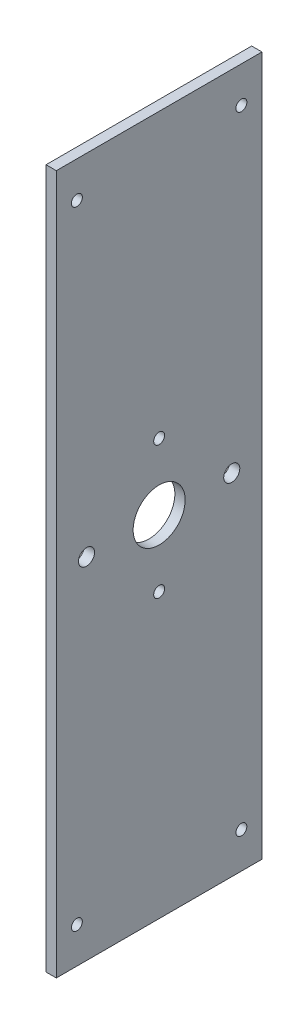
ISO-10303-21;
HEADER;
FILE_DESCRIPTION(('STEP AP214'),'2;1');
FILE_NAME('part.step','',(''),(''),'','','');
FILE_SCHEMA(('AUTOMOTIVE_DESIGN { 1 0 10303 214 1 1 1 1 }'));
ENDSEC;
DATA;
#1=APPLICATION_CONTEXT('core data for automotive mechanical design processes');
#2=APPLICATION_PROTOCOL_DEFINITION('international standard','automotive_design',2000,#1);
#3=PRODUCT_CONTEXT('',#1,'mechanical');
#4=PRODUCT('Part','Part','',(#3));
#5=PRODUCT_RELATED_PRODUCT_CATEGORY('part','',(#4));
#6=PRODUCT_DEFINITION_FORMATION('','',#4);
#7=PRODUCT_DEFINITION_CONTEXT('part definition',#1,'design');
#8=PRODUCT_DEFINITION('design','',#6,#7);
#9=PRODUCT_DEFINITION_SHAPE('','',#8);
#10=(LENGTH_UNIT() NAMED_UNIT(*) SI_UNIT(.MILLI.,.METRE.));
#11=(NAMED_UNIT(*) PLANE_ANGLE_UNIT() SI_UNIT($,.RADIAN.));
#12=(NAMED_UNIT(*) SI_UNIT($,.STERADIAN.) SOLID_ANGLE_UNIT());
#13=UNCERTAINTY_MEASURE_WITH_UNIT(LENGTH_MEASURE(1.E-05),#10,'distance_accuracy_value','');
#14=(GEOMETRIC_REPRESENTATION_CONTEXT(3) GLOBAL_UNCERTAINTY_ASSIGNED_CONTEXT((#13)) GLOBAL_UNIT_ASSIGNED_CONTEXT((#10,
#11,#12)) REPRESENTATION_CONTEXT('',''));
#15=CARTESIAN_POINT('',(0.,0.,0.));
#16=DIRECTION('',(0.,0.,1.));
#17=DIRECTION('',(1.,0.,0.));
#18=AXIS2_PLACEMENT_3D('',#15,#16,#17);
#19=CARTESIAN_POINT('',(-165.1,215.9,2082.8));
#20=DIRECTION('',(-1.,0.,0.));
#21=DIRECTION('',(0.,0.,1.));
#22=AXIS2_PLACEMENT_3D('',#19,#20,#21);
#23=PLANE('',#22);
#24=CARTESIAN_POINT('',(-165.1,0.,1666.4813));
#25=DIRECTION('',(-1.,0.,0.));
#26=DIRECTION('',(0.,0.,1.));
#27=AXIS2_PLACEMENT_3D('',#24,#25,#26);
#28=CIRCLE('',#27,4.96570000000007);
#29=CARTESIAN_POINT('',(-165.1,0.,1671.447));
#30=VERTEX_POINT('',#29);
#31=EDGE_CURVE('E19',#30,#30,#28,.F.);
#32=ORIENTED_EDGE('',*,*,#31,.T.);
#33=EDGE_LOOP('',(#32));
#34=FACE_BOUND('',#33,.T.);
#35=CARTESIAN_POINT('',(-165.1,0.,1756.1687));
#36=DIRECTION('',(-1.,0.,0.));
#37=DIRECTION('',(0.,0.,1.));
#38=AXIS2_PLACEMENT_3D('',#35,#36,#37);
#39=CIRCLE('',#38,4.96570000000007);
#40=CARTESIAN_POINT('',(-165.1,0.,1761.1344));
#41=VERTEX_POINT('',#40);
#42=EDGE_CURVE('E153',#41,#41,#39,.F.);
#43=ORIENTED_EDGE('',*,*,#42,.T.);
#44=EDGE_LOOP('',(#43));
#45=FACE_BOUND('',#44,.T.);
#46=CARTESIAN_POINT('',(-165.1,193.675,1660.525));
#47=DIRECTION('',(-1.,0.,0.));
#48=DIRECTION('',(0.,0.,1.));
#49=AXIS2_PLACEMENT_3D('',#46,#47,#48);
#50=CIRCLE('',#49,3.3782);
#51=CARTESIAN_POINT('',(-165.1,193.675,1663.9032));
#52=VERTEX_POINT('',#51);
#53=EDGE_CURVE('E149',#52,#52,#50,.F.);
#54=ORIENTED_EDGE('',*,*,#53,.T.);
#55=EDGE_LOOP('',(#54));
#56=FACE_BOUND('',#55,.T.);
#57=CARTESIAN_POINT('',(-165.1,193.675,1762.125));
#58=DIRECTION('',(-1.,0.,0.));
#59=DIRECTION('',(0.,0.,1.));
#60=AXIS2_PLACEMENT_3D('',#57,#58,#59);
#61=CIRCLE('',#60,3.3782);
#62=CARTESIAN_POINT('',(-165.1,193.675,1765.5032));
#63=VERTEX_POINT('',#62);
#64=EDGE_CURVE('E144',#63,#63,#61,.F.);
#65=ORIENTED_EDGE('',*,*,#64,.T.);
#66=EDGE_LOOP('',(#65));
#67=FACE_BOUND('',#66,.T.);
#68=CARTESIAN_POINT('',(-165.1,-193.675,1660.525));
#69=DIRECTION('',(-1.,0.,0.));
#70=DIRECTION('',(0.,0.,1.));
#71=AXIS2_PLACEMENT_3D('',#68,#69,#70);
#72=CIRCLE('',#71,3.3782);
#73=CARTESIAN_POINT('',(-165.1,-193.675,1663.9032));
#74=VERTEX_POINT('',#73);
#75=EDGE_CURVE('E139',#74,#74,#72,.F.);
#76=ORIENTED_EDGE('',*,*,#75,.T.);
#77=EDGE_LOOP('',(#76));
#78=FACE_BOUND('',#77,.T.);
#79=CARTESIAN_POINT('',(-165.1,-193.675,1762.125));
#80=DIRECTION('',(-1.,0.,0.));
#81=DIRECTION('',(0.,0.,1.));
#82=AXIS2_PLACEMENT_3D('',#79,#80,#81);
#83=CIRCLE('',#82,3.3782);
#84=CARTESIAN_POINT('',(-165.1,-193.675,1765.5032));
#85=VERTEX_POINT('',#84);
#86=EDGE_CURVE('E134',#85,#85,#83,.F.);
#87=ORIENTED_EDGE('',*,*,#86,.T.);
#88=EDGE_LOOP('',(#87));
#89=FACE_BOUND('',#88,.T.);
#90=CARTESIAN_POINT('',(-165.1,41.021,1711.325));
#91=DIRECTION('',(-1.,0.,0.));
#92=DIRECTION('',(0.,0.,1.));
#93=AXIS2_PLACEMENT_3D('',#90,#91,#92);
#94=CIRCLE('',#93,3.36549999999991);
#95=CARTESIAN_POINT('',(-165.1,41.021,1714.6905));
#96=VERTEX_POINT('',#95);
#97=EDGE_CURVE('E129',#96,#96,#94,.F.);
#98=ORIENTED_EDGE('',*,*,#97,.T.);
#99=EDGE_LOOP('',(#98));
#100=FACE_BOUND('',#99,.T.);
#101=CARTESIAN_POINT('',(-165.1,-41.021,1711.325));
#102=DIRECTION('',(-1.,0.,0.));
#103=DIRECTION('',(0.,0.,1.));
#104=AXIS2_PLACEMENT_3D('',#101,#102,#103);
#105=CIRCLE('',#104,3.36549999999991);
#106=CARTESIAN_POINT('',(-165.1,-41.021,1714.6905));
#107=VERTEX_POINT('',#106);
#108=EDGE_CURVE('E124',#107,#107,#105,.F.);
#109=ORIENTED_EDGE('',*,*,#108,.T.);
#110=EDGE_LOOP('',(#109));
#111=FACE_BOUND('',#110,.T.);
#112=CARTESIAN_POINT('',(-165.1,0.,1711.325));
#113=DIRECTION('',(-1.,0.,0.));
#114=DIRECTION('',(0.,0.,1.));
#115=AXIS2_PLACEMENT_3D('',#112,#113,#114);
#116=CIRCLE('',#115,16.0655);
#117=CARTESIAN_POINT('',(-165.1,0.,1727.3905));
#118=VERTEX_POINT('',#117);
#119=EDGE_CURVE('E110',#118,#118,#116,.F.);
#120=ORIENTED_EDGE('',*,*,#119,.T.);
#121=EDGE_LOOP('',(#120));
#122=FACE_BOUND('',#121,.T.);
#123=DIRECTION('',(0.,0.,-1.));
#124=VECTOR('',#123,1.);
#125=CARTESIAN_POINT('',(-165.1,-215.9,2082.8));
#126=LINE('',#125,#124);
#127=CARTESIAN_POINT('',(-165.1,-215.9,1774.825));
#128=VERTEX_POINT('',#127);
#129=CARTESIAN_POINT('',(-165.1,-215.9,1647.825));
#130=VERTEX_POINT('',#129);
#131=EDGE_CURVE('E105',#128,#130,#126,.T.);
#132=ORIENTED_EDGE('',*,*,#131,.F.);
#133=DIRECTION('',(0.,-1.,0.));
#134=VECTOR('',#133,1.);
#135=CARTESIAN_POINT('',(-165.1,215.9,1774.825));
#136=LINE('',#135,#134);
#137=CARTESIAN_POINT('',(-165.1,215.9,1774.825));
#138=VERTEX_POINT('',#137);
#139=EDGE_CURVE('E40',#138,#128,#136,.T.);
#140=ORIENTED_EDGE('',*,*,#139,.F.);
#141=DIRECTION('',(0.,0.,-1.));
#142=VECTOR('',#141,1.);
#143=CARTESIAN_POINT('',(-165.1,215.9,2082.8));
#144=LINE('',#143,#142);
#145=CARTESIAN_POINT('',(-165.1,215.9,1647.825));
#146=VERTEX_POINT('',#145);
#147=EDGE_CURVE('E92',#138,#146,#144,.T.);
#148=ORIENTED_EDGE('',*,*,#147,.T.);
#149=DIRECTION('',(0.,-1.,0.));
#150=VECTOR('',#149,1.);
#151=CARTESIAN_POINT('',(-165.1,215.9,1647.825));
#152=LINE('',#151,#150);
#153=EDGE_CURVE('E11',#146,#130,#152,.T.);
#154=ORIENTED_EDGE('',*,*,#153,.T.);
#155=EDGE_LOOP('',(#132,#140,#148,#154));
#156=FACE_BOUND('',#155,.T.);
#157=ADVANCED_FACE('F16',(#34,#45,#56,#67,#78,#89,#100,#111,#122,#156),#23,.T.);
#158=CARTESIAN_POINT('',(-161.657917049904,215.9,1647.825));
#159=DIRECTION('',(0.,0.,-1.));
#160=DIRECTION('',(-1.,0.,0.));
#161=AXIS2_PLACEMENT_3D('',#158,#159,#160);
#162=PLANE('',#161);
#163=DIRECTION('',(1.,0.,0.));
#164=VECTOR('',#163,1.);
#165=CARTESIAN_POINT('',(-161.657917049904,-215.9,1647.825));
#166=LINE('',#165,#164);
#167=CARTESIAN_POINT('',(-158.75,-215.9,1647.825));
#168=VERTEX_POINT('',#167);
#169=EDGE_CURVE('E109',#130,#168,#166,.T.);
#170=ORIENTED_EDGE('',*,*,#169,.F.);
#171=ORIENTED_EDGE('',*,*,#153,.F.);
#172=DIRECTION('',(1.,0.,0.));
#173=VECTOR('',#172,1.);
#174=CARTESIAN_POINT('',(-161.657917049904,215.9,1647.825));
#175=LINE('',#174,#173);
#176=CARTESIAN_POINT('',(-158.75,215.9,1647.825));
#177=VERTEX_POINT('',#176);
#178=EDGE_CURVE('E87',#146,#177,#175,.T.);
#179=ORIENTED_EDGE('',*,*,#178,.T.);
#180=DIRECTION('',(0.,-1.,0.));
#181=VECTOR('',#180,1.);
#182=CARTESIAN_POINT('',(-158.75,215.9,1647.825));
#183=LINE('',#182,#181);
#184=EDGE_CURVE('E26',#177,#168,#183,.T.);
#185=ORIENTED_EDGE('',*,*,#184,.T.);
#186=EDGE_LOOP('',(#170,#171,#179,#185));
#187=FACE_BOUND('',#186,.T.);
#188=ADVANCED_FACE('F88',(#187),#162,.T.);
#189=CARTESIAN_POINT('',(-158.75,215.9,1176.90814380646));
#190=DIRECTION('',(-1.,0.,0.));
#191=DIRECTION('',(0.,0.,1.));
#192=AXIS2_PLACEMENT_3D('',#189,#190,#191);
#193=PLANE('',#192);
#194=CARTESIAN_POINT('',(-158.75,0.,1666.4813));
#195=DIRECTION('',(1.,0.,0.));
#196=DIRECTION('',(0.,0.,-1.));
#197=AXIS2_PLACEMENT_3D('',#194,#195,#196);
#198=CIRCLE('',#197,4.96570000000007);
#199=CARTESIAN_POINT('',(-158.75,0.,1661.5156));
#200=VERTEX_POINT('',#199);
#201=EDGE_CURVE('E173',#200,#200,#198,.T.);
#202=ORIENTED_EDGE('',*,*,#201,.F.);
#203=EDGE_LOOP('',(#202));
#204=FACE_BOUND('',#203,.T.);
#205=CARTESIAN_POINT('',(-158.75,0.,1756.1687));
#206=DIRECTION('',(1.,0.,0.));
#207=DIRECTION('',(0.,0.,-1.));
#208=AXIS2_PLACEMENT_3D('',#205,#206,#207);
#209=CIRCLE('',#208,4.96570000000007);
#210=CARTESIAN_POINT('',(-158.75,0.,1751.203));
#211=VERTEX_POINT('',#210);
#212=EDGE_CURVE('E156',#211,#211,#209,.T.);
#213=ORIENTED_EDGE('',*,*,#212,.F.);
#214=EDGE_LOOP('',(#213));
#215=FACE_BOUND('',#214,.T.);
#216=CARTESIAN_POINT('',(-158.75,193.675,1660.525));
#217=DIRECTION('',(1.,0.,0.));
#218=DIRECTION('',(0.,0.,-1.));
#219=AXIS2_PLACEMENT_3D('',#216,#217,#218);
#220=CIRCLE('',#219,3.3782);
#221=CARTESIAN_POINT('',(-158.75,193.675,1657.1468));
#222=VERTEX_POINT('',#221);
#223=EDGE_CURVE('E152',#222,#222,#220,.T.);
#224=ORIENTED_EDGE('',*,*,#223,.F.);
#225=EDGE_LOOP('',(#224));
#226=FACE_BOUND('',#225,.T.);
#227=CARTESIAN_POINT('',(-158.75,193.675,1762.125));
#228=DIRECTION('',(1.,0.,0.));
#229=DIRECTION('',(0.,0.,-1.));
#230=AXIS2_PLACEMENT_3D('',#227,#228,#229);
#231=CIRCLE('',#230,3.3782);
#232=CARTESIAN_POINT('',(-158.75,193.675,1758.7468));
#233=VERTEX_POINT('',#232);
#234=EDGE_CURVE('E148',#233,#233,#231,.T.);
#235=ORIENTED_EDGE('',*,*,#234,.F.);
#236=EDGE_LOOP('',(#235));
#237=FACE_BOUND('',#236,.T.);
#238=CARTESIAN_POINT('',(-158.75,-193.675,1660.525));
#239=DIRECTION('',(1.,0.,0.));
#240=DIRECTION('',(0.,0.,-1.));
#241=AXIS2_PLACEMENT_3D('',#238,#239,#240);
#242=CIRCLE('',#241,3.3782);
#243=CARTESIAN_POINT('',(-158.75,-193.675,1657.1468));
#244=VERTEX_POINT('',#243);
#245=EDGE_CURVE('E143',#244,#244,#242,.T.);
#246=ORIENTED_EDGE('',*,*,#245,.F.);
#247=EDGE_LOOP('',(#246));
#248=FACE_BOUND('',#247,.T.);
#249=CARTESIAN_POINT('',(-158.75,-193.675,1762.125));
#250=DIRECTION('',(1.,0.,0.));
#251=DIRECTION('',(0.,0.,-1.));
#252=AXIS2_PLACEMENT_3D('',#249,#250,#251);
#253=CIRCLE('',#252,3.3782);
#254=CARTESIAN_POINT('',(-158.75,-193.675,1758.7468));
#255=VERTEX_POINT('',#254);
#256=EDGE_CURVE('E138',#255,#255,#253,.T.);
#257=ORIENTED_EDGE('',*,*,#256,.F.);
#258=EDGE_LOOP('',(#257));
#259=FACE_BOUND('',#258,.T.);
#260=CARTESIAN_POINT('',(-158.75,41.021,1711.325));
#261=DIRECTION('',(1.,0.,0.));
#262=DIRECTION('',(0.,0.,-1.));
#263=AXIS2_PLACEMENT_3D('',#260,#261,#262);
#264=CIRCLE('',#263,3.36549999999991);
#265=CARTESIAN_POINT('',(-158.75,41.021,1707.9595));
#266=VERTEX_POINT('',#265);
#267=EDGE_CURVE('E133',#266,#266,#264,.T.);
#268=ORIENTED_EDGE('',*,*,#267,.F.);
#269=EDGE_LOOP('',(#268));
#270=FACE_BOUND('',#269,.T.);
#271=CARTESIAN_POINT('',(-158.75,-41.021,1711.325));
#272=DIRECTION('',(1.,0.,0.));
#273=DIRECTION('',(0.,0.,-1.));
#274=AXIS2_PLACEMENT_3D('',#271,#272,#273);
#275=CIRCLE('',#274,3.36549999999991);
#276=CARTESIAN_POINT('',(-158.75,-41.021,1707.9595));
#277=VERTEX_POINT('',#276);
#278=EDGE_CURVE('E128',#277,#277,#275,.T.);
#279=ORIENTED_EDGE('',*,*,#278,.F.);
#280=EDGE_LOOP('',(#279));
#281=FACE_BOUND('',#280,.T.);
#282=CARTESIAN_POINT('',(-158.75,0.,1711.325));
#283=DIRECTION('',(1.,0.,0.));
#284=DIRECTION('',(0.,0.,-1.));
#285=AXIS2_PLACEMENT_3D('',#282,#283,#284);
#286=CIRCLE('',#285,16.0655);
#287=CARTESIAN_POINT('',(-158.75,0.,1695.2595));
#288=VERTEX_POINT('',#287);
#289=EDGE_CURVE('E123',#288,#288,#286,.T.);
#290=ORIENTED_EDGE('',*,*,#289,.F.);
#291=EDGE_LOOP('',(#290));
#292=FACE_BOUND('',#291,.T.);
#293=DIRECTION('',(0.,0.,-1.));
#294=VECTOR('',#293,1.);
#295=CARTESIAN_POINT('',(-158.75,-215.9,1176.90814380646));
#296=LINE('',#295,#294);
#297=CARTESIAN_POINT('',(-158.75,-215.9,1774.825));
#298=VERTEX_POINT('',#297);
#299=EDGE_CURVE('E83',#298,#168,#296,.T.);
#300=ORIENTED_EDGE('',*,*,#299,.T.);
#301=ORIENTED_EDGE('',*,*,#184,.F.);
#302=DIRECTION('',(0.,0.,-1.));
#303=VECTOR('',#302,1.);
#304=CARTESIAN_POINT('',(-158.75,215.9,1176.90814380646));
#305=LINE('',#304,#303);
#306=CARTESIAN_POINT('',(-158.75,215.9,1774.825));
#307=VERTEX_POINT('',#306);
#308=EDGE_CURVE('E80',#307,#177,#305,.T.);
#309=ORIENTED_EDGE('',*,*,#308,.F.);
#310=DIRECTION('',(0.,-1.,0.));
#311=VECTOR('',#310,1.);
#312=CARTESIAN_POINT('',(-158.75,215.9,1774.825));
#313=LINE('',#312,#311);
#314=EDGE_CURVE('E60',#307,#298,#313,.T.);
#315=ORIENTED_EDGE('',*,*,#314,.T.);
#316=EDGE_LOOP('',(#300,#301,#309,#315));
#317=FACE_BOUND('',#316,.T.);
#318=ADVANCED_FACE('F78',(#204,#215,#226,#237,#248,#259,#270,#281,#292,#317),#193,.F.);
#319=CARTESIAN_POINT('',(-161.657917049904,215.9,1774.825));
#320=DIRECTION('',(0.,0.,-1.));
#321=DIRECTION('',(-1.,0.,0.));
#322=AXIS2_PLACEMENT_3D('',#319,#320,#321);
#323=PLANE('',#322);
#324=DIRECTION('',(1.,0.,0.));
#325=VECTOR('',#324,1.);
#326=CARTESIAN_POINT('',(-161.657917049904,-215.9,1774.825));
#327=LINE('',#326,#325);
#328=EDGE_CURVE('E114',#128,#298,#327,.T.);
#329=ORIENTED_EDGE('',*,*,#328,.T.);
#330=ORIENTED_EDGE('',*,*,#314,.F.);
#331=DIRECTION('',(1.,0.,0.));
#332=VECTOR('',#331,1.);
#333=CARTESIAN_POINT('',(-161.657917049904,215.9,1774.825));
#334=LINE('',#333,#332);
#335=EDGE_CURVE('E95',#138,#307,#334,.T.);
#336=ORIENTED_EDGE('',*,*,#335,.F.);
#337=ORIENTED_EDGE('',*,*,#139,.T.);
#338=EDGE_LOOP('',(#329,#330,#336,#337));
#339=FACE_BOUND('',#338,.T.);
#340=ADVANCED_FACE('F197',(#339),#323,.F.);
#341=CARTESIAN_POINT('',(-187.325,215.9,1041.4));
#342=DIRECTION('',(0.,-1.,0.));
#343=DIRECTION('',(1.,0.,0.));
#344=AXIS2_PLACEMENT_3D('',#341,#342,#343);
#345=PLANE('',#344);
#346=ORIENTED_EDGE('',*,*,#147,.F.);
#347=ORIENTED_EDGE('',*,*,#335,.T.);
#348=ORIENTED_EDGE('',*,*,#308,.T.);
#349=ORIENTED_EDGE('',*,*,#178,.F.);
#350=EDGE_LOOP('',(#346,#347,#348,#349));
#351=FACE_BOUND('',#350,.T.);
#352=ADVANCED_FACE('F94',(#351),#345,.F.);
#353=CARTESIAN_POINT('',(-187.325,-215.9,1041.4));
#354=DIRECTION('',(0.,-1.,0.));
#355=DIRECTION('',(1.,0.,0.));
#356=AXIS2_PLACEMENT_3D('',#353,#354,#355);
#357=PLANE('',#356);
#358=ORIENTED_EDGE('',*,*,#131,.T.);
#359=ORIENTED_EDGE('',*,*,#169,.T.);
#360=ORIENTED_EDGE('',*,*,#299,.F.);
#361=ORIENTED_EDGE('',*,*,#328,.F.);
#362=EDGE_LOOP('',(#358,#359,#360,#361));
#363=FACE_BOUND('',#362,.T.);
#364=ADVANCED_FACE('F196',(#363),#357,.T.);
#365=CARTESIAN_POINT('',(-613.710501538055,0.,1711.325));
#366=DIRECTION('',(1.,0.,0.));
#367=DIRECTION('',(0.,0.,-1.));
#368=AXIS2_PLACEMENT_3D('',#365,#366,#367);
#369=CYLINDRICAL_SURFACE('',#368,16.0655);
#370=ORIENTED_EDGE('',*,*,#119,.F.);
#371=EDGE_LOOP('',(#370));
#372=FACE_BOUND('',#371,.T.);
#373=ORIENTED_EDGE('',*,*,#289,.T.);
#374=EDGE_LOOP('',(#373));
#375=FACE_BOUND('',#374,.T.);
#376=ADVANCED_FACE('F230',(#372,#375),#369,.F.);
#377=CARTESIAN_POINT('',(-609.89503660723,-41.021,1711.325));
#378=DIRECTION('',(1.,0.,0.));
#379=DIRECTION('',(0.,0.,-1.));
#380=AXIS2_PLACEMENT_3D('',#377,#378,#379);
#381=CYLINDRICAL_SURFACE('',#380,3.36549999999991);
#382=ORIENTED_EDGE('',*,*,#108,.F.);
#383=EDGE_LOOP('',(#382));
#384=FACE_BOUND('',#383,.T.);
#385=ORIENTED_EDGE('',*,*,#278,.T.);
#386=EDGE_LOOP('',(#385));
#387=FACE_BOUND('',#386,.T.);
#388=ADVANCED_FACE('F233',(#384,#387),#381,.F.);
#389=CARTESIAN_POINT('',(-609.89503660723,41.021,1711.325));
#390=DIRECTION('',(1.,0.,0.));
#391=DIRECTION('',(0.,0.,-1.));
#392=AXIS2_PLACEMENT_3D('',#389,#390,#391);
#393=CYLINDRICAL_SURFACE('',#392,3.36549999999991);
#394=ORIENTED_EDGE('',*,*,#97,.F.);
#395=EDGE_LOOP('',(#394));
#396=FACE_BOUND('',#395,.T.);
#397=ORIENTED_EDGE('',*,*,#267,.T.);
#398=EDGE_LOOP('',(#397));
#399=FACE_BOUND('',#398,.T.);
#400=ADVANCED_FACE('F241',(#396,#399),#393,.F.);
#401=CARTESIAN_POINT('',(-2287.62139438171,-193.675,1762.125));
#402=DIRECTION('',(1.,0.,0.));
#403=DIRECTION('',(0.,0.,-1.));
#404=AXIS2_PLACEMENT_3D('',#401,#402,#403);
#405=CYLINDRICAL_SURFACE('',#404,3.3782);
#406=ORIENTED_EDGE('',*,*,#86,.F.);
#407=EDGE_LOOP('',(#406));
#408=FACE_BOUND('',#407,.T.);
#409=ORIENTED_EDGE('',*,*,#256,.T.);
#410=EDGE_LOOP('',(#409));
#411=FACE_BOUND('',#410,.T.);
#412=ADVANCED_FACE('F247',(#408,#411),#405,.F.);
#413=CARTESIAN_POINT('',(-2287.62139438171,-193.675,1660.525));
#414=DIRECTION('',(1.,0.,0.));
#415=DIRECTION('',(0.,0.,-1.));
#416=AXIS2_PLACEMENT_3D('',#413,#414,#415);
#417=CYLINDRICAL_SURFACE('',#416,3.3782);
#418=ORIENTED_EDGE('',*,*,#75,.F.);
#419=EDGE_LOOP('',(#418));
#420=FACE_BOUND('',#419,.T.);
#421=ORIENTED_EDGE('',*,*,#245,.T.);
#422=EDGE_LOOP('',(#421));
#423=FACE_BOUND('',#422,.T.);
#424=ADVANCED_FACE('F251',(#420,#423),#417,.F.);
#425=CARTESIAN_POINT('',(-2287.62139438171,193.675,1762.125));
#426=DIRECTION('',(1.,0.,0.));
#427=DIRECTION('',(0.,0.,-1.));
#428=AXIS2_PLACEMENT_3D('',#425,#426,#427);
#429=CYLINDRICAL_SURFACE('',#428,3.3782);
#430=ORIENTED_EDGE('',*,*,#64,.F.);
#431=EDGE_LOOP('',(#430));
#432=FACE_BOUND('',#431,.T.);
#433=ORIENTED_EDGE('',*,*,#234,.T.);
#434=EDGE_LOOP('',(#433));
#435=FACE_BOUND('',#434,.T.);
#436=ADVANCED_FACE('F255',(#432,#435),#429,.F.);
#437=CARTESIAN_POINT('',(-2287.62139438171,193.675,1660.525));
#438=DIRECTION('',(1.,0.,0.));
#439=DIRECTION('',(0.,0.,-1.));
#440=AXIS2_PLACEMENT_3D('',#437,#438,#439);
#441=CYLINDRICAL_SURFACE('',#440,3.3782);
#442=ORIENTED_EDGE('',*,*,#53,.F.);
#443=EDGE_LOOP('',(#442));
#444=FACE_BOUND('',#443,.T.);
#445=ORIENTED_EDGE('',*,*,#223,.T.);
#446=EDGE_LOOP('',(#445));
#447=FACE_BOUND('',#446,.T.);
#448=ADVANCED_FACE('F259',(#444,#447),#441,.F.);
#449=CARTESIAN_POINT('',(-610.375785188514,0.,1756.1687));
#450=DIRECTION('',(1.,0.,0.));
#451=DIRECTION('',(0.,0.,-1.));
#452=AXIS2_PLACEMENT_3D('',#449,#450,#451);
#453=CYLINDRICAL_SURFACE('',#452,4.96570000000007);
#454=ORIENTED_EDGE('',*,*,#42,.F.);
#455=EDGE_LOOP('',(#454));
#456=FACE_BOUND('',#455,.T.);
#457=ORIENTED_EDGE('',*,*,#212,.T.);
#458=EDGE_LOOP('',(#457));
#459=FACE_BOUND('',#458,.T.);
#460=ADVANCED_FACE('F263',(#456,#459),#453,.F.);
#461=CARTESIAN_POINT('',(-610.375785188514,0.,1666.4813));
#462=DIRECTION('',(1.,0.,0.));
#463=DIRECTION('',(0.,0.,-1.));
#464=AXIS2_PLACEMENT_3D('',#461,#462,#463);
#465=CYLINDRICAL_SURFACE('',#464,4.96570000000007);
#466=ORIENTED_EDGE('',*,*,#31,.F.);
#467=EDGE_LOOP('',(#466));
#468=FACE_BOUND('',#467,.T.);
#469=ORIENTED_EDGE('',*,*,#201,.T.);
#470=EDGE_LOOP('',(#469));
#471=FACE_BOUND('',#470,.T.);
#472=ADVANCED_FACE('F267',(#468,#471),#465,.F.);
#473=CLOSED_SHELL('',(#157,#188,#318,#340,#352,#364,#376,#388,#400,#412,#424,#436,#448,#460,#472));
#474=MANIFOLD_SOLID_BREP('B1',#473);
#475=ADVANCED_BREP_SHAPE_REPRESENTATION('',(#18,#474),#14);
#476=SHAPE_DEFINITION_REPRESENTATION(#9,#475);
ENDSEC;
END-ISO-10303-21;
